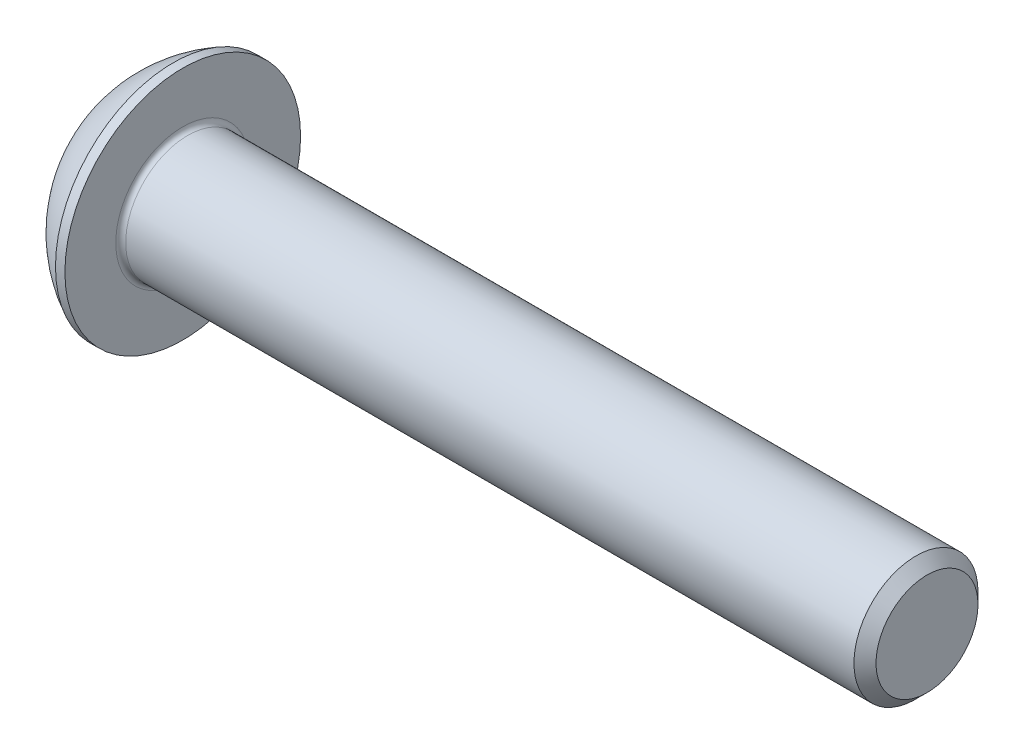
ISO-10303-21;
HEADER;
FILE_DESCRIPTION(('STEP AP214'),'2;1');
FILE_NAME('part.step','',(''),(''),'','','');
FILE_SCHEMA(('AUTOMOTIVE_DESIGN { 1 0 10303 214 1 1 1 1 }'));
ENDSEC;
DATA;
#1=APPLICATION_CONTEXT('core data for automotive mechanical design processes');
#2=APPLICATION_PROTOCOL_DEFINITION('international standard','automotive_design',2000,#1);
#3=PRODUCT_CONTEXT('',#1,'mechanical');
#4=PRODUCT('Part','Part','',(#3));
#5=PRODUCT_RELATED_PRODUCT_CATEGORY('part','',(#4));
#6=PRODUCT_DEFINITION_FORMATION('','',#4);
#7=PRODUCT_DEFINITION_CONTEXT('part definition',#1,'design');
#8=PRODUCT_DEFINITION('design','',#6,#7);
#9=PRODUCT_DEFINITION_SHAPE('','',#8);
#10=(LENGTH_UNIT() NAMED_UNIT(*) SI_UNIT(.MILLI.,.METRE.));
#11=(NAMED_UNIT(*) PLANE_ANGLE_UNIT() SI_UNIT($,.RADIAN.));
#12=(NAMED_UNIT(*) SI_UNIT($,.STERADIAN.) SOLID_ANGLE_UNIT());
#13=UNCERTAINTY_MEASURE_WITH_UNIT(LENGTH_MEASURE(1.E-05),#10,'distance_accuracy_value','');
#14=(GEOMETRIC_REPRESENTATION_CONTEXT(3) GLOBAL_UNCERTAINTY_ASSIGNED_CONTEXT((#13)) GLOBAL_UNIT_ASSIGNED_CONTEXT((#10,
#11,#12)) REPRESENTATION_CONTEXT('',''));
#15=CARTESIAN_POINT('',(0.,0.,0.));
#16=DIRECTION('',(0.,0.,1.));
#17=DIRECTION('',(1.,0.,0.));
#18=AXIS2_PLACEMENT_3D('',#15,#16,#17);
#19=CARTESIAN_POINT('',(-574.924243785843,0.,0.));
#20=DIRECTION('',(-1.,0.,0.));
#21=DIRECTION('',(0.,0.,1.));
#22=AXIS2_PLACEMENT_3D('',#19,#20,#21);
#23=CONICAL_SURFACE('',#22,1000.,1.0471975511966);
#24=DIRECTION('',(-0.5,0.,-0.866025403784438));
#25=VECTOR('',#24,1.);
#26=CARTESIAN_POINT('',(-574.924243785843,-1.22464679914735E-13,-1000.));
#27=LINE('',#26,#25);
#28=CARTESIAN_POINT('',(2.42602540378445,0.,0.));
#29=VERTEX_POINT('',#28);
#30=CARTESIAN_POINT('',(1.56,0.,-1.5));
#31=VERTEX_POINT('',#30);
#32=EDGE_CURVE('E11',#29,#31,#27,.T.);
#33=ORIENTED_EDGE('',*,*,#32,.T.);
#34=CARTESIAN_POINT('',(1.56,0.,0.));
#35=DIRECTION('',(-1.,0.,0.));
#36=DIRECTION('',(0.,0.,1.));
#37=AXIS2_PLACEMENT_3D('',#34,#35,#36);
#38=CIRCLE('',#37,1.5);
#39=CARTESIAN_POINT('',(1.56,-1.29903810567666,-0.75));
#40=VERTEX_POINT('',#39);
#41=EDGE_CURVE('E124',#31,#40,#38,.T.);
#42=ORIENTED_EDGE('',*,*,#41,.T.);
#43=CARTESIAN_POINT('',(1.56,0.,0.));
#44=DIRECTION('',(-1.,0.,0.));
#45=DIRECTION('',(0.,0.,1.));
#46=AXIS2_PLACEMENT_3D('',#43,#44,#45);
#47=CIRCLE('',#46,1.5);
#48=CARTESIAN_POINT('',(1.56,-1.29903810567666,0.75));
#49=VERTEX_POINT('',#48);
#50=EDGE_CURVE('E119',#40,#49,#47,.T.);
#51=ORIENTED_EDGE('',*,*,#50,.T.);
#52=CARTESIAN_POINT('',(1.56,0.,0.));
#53=DIRECTION('',(-1.,0.,0.));
#54=DIRECTION('',(0.,0.,1.));
#55=AXIS2_PLACEMENT_3D('',#52,#53,#54);
#56=CIRCLE('',#55,1.5);
#57=CARTESIAN_POINT('',(1.56,0.,1.5));
#58=VERTEX_POINT('',#57);
#59=EDGE_CURVE('E27',#49,#58,#56,.T.);
#60=ORIENTED_EDGE('',*,*,#59,.T.);
#61=CARTESIAN_POINT('',(1.56,0.,0.));
#62=DIRECTION('',(-1.,0.,0.));
#63=DIRECTION('',(0.,0.,1.));
#64=AXIS2_PLACEMENT_3D('',#61,#62,#63);
#65=CIRCLE('',#64,1.5);
#66=CARTESIAN_POINT('',(1.56,1.29903810567666,0.75));
#67=VERTEX_POINT('',#66);
#68=EDGE_CURVE('E228',#58,#67,#65,.T.);
#69=ORIENTED_EDGE('',*,*,#68,.T.);
#70=CARTESIAN_POINT('',(1.56,0.,0.));
#71=DIRECTION('',(-1.,0.,0.));
#72=DIRECTION('',(0.,0.,1.));
#73=AXIS2_PLACEMENT_3D('',#70,#71,#72);
#74=CIRCLE('',#73,1.5);
#75=CARTESIAN_POINT('',(1.56,1.29903810567666,-0.75));
#76=VERTEX_POINT('',#75);
#77=EDGE_CURVE('E231',#67,#76,#74,.T.);
#78=ORIENTED_EDGE('',*,*,#77,.T.);
#79=CARTESIAN_POINT('',(1.56,0.,0.));
#80=DIRECTION('',(-1.,0.,0.));
#81=DIRECTION('',(0.,0.,1.));
#82=AXIS2_PLACEMENT_3D('',#79,#80,#81);
#83=CIRCLE('',#82,1.5);
#84=EDGE_CURVE('E168',#76,#31,#83,.T.);
#85=ORIENTED_EDGE('',*,*,#84,.T.);
#86=ORIENTED_EDGE('',*,*,#32,.F.);
#87=EDGE_LOOP('',(#33,#42,#51,#60,#69,#78,#85,#86));
#88=FACE_BOUND('',#87,.T.);
#89=ADVANCED_FACE('F16',(#88),#23,.F.);
#90=CARTESIAN_POINT('',(1.56,0.,3.));
#91=DIRECTION('',(-1.,0.,0.));
#92=DIRECTION('',(0.,0.,1.));
#93=AXIS2_PLACEMENT_3D('',#90,#91,#92);
#94=PLANE('',#93);
#95=DIRECTION('',(0.,-0.5,-0.866025403784439));
#96=VECTOR('',#95,1.);
#97=CARTESIAN_POINT('',(1.56,-0.86602540378444,1.5));
#98=LINE('',#97,#96);
#99=CARTESIAN_POINT('',(1.56,-0.866025403784438,1.5));
#100=VERTEX_POINT('',#99);
#101=EDGE_CURVE('E113',#100,#49,#98,.T.);
#102=ORIENTED_EDGE('',*,*,#101,.F.);
#103=DIRECTION('',(0.,-1.,0.));
#104=VECTOR('',#103,1.);
#105=CARTESIAN_POINT('',(1.56,0.,1.5));
#106=LINE('',#105,#104);
#107=EDGE_CURVE('E114',#58,#100,#106,.T.);
#108=ORIENTED_EDGE('',*,*,#107,.F.);
#109=ORIENTED_EDGE('',*,*,#59,.F.);
#110=EDGE_LOOP('',(#102,#108,#109));
#111=FACE_BOUND('',#110,.T.);
#112=ADVANCED_FACE('F111',(#111),#94,.T.);
#113=CARTESIAN_POINT('',(1.56,0.,3.));
#114=DIRECTION('',(-1.,0.,0.));
#115=DIRECTION('',(0.,0.,1.));
#116=AXIS2_PLACEMENT_3D('',#113,#114,#115);
#117=PLANE('',#116);
#118=DIRECTION('',(0.,0.5,-0.866025403784439));
#119=VECTOR('',#118,1.);
#120=CARTESIAN_POINT('',(1.56,-1.73205080756888,0.));
#121=LINE('',#120,#119);
#122=CARTESIAN_POINT('',(1.56,-1.73205080756888,0.));
#123=VERTEX_POINT('',#122);
#124=EDGE_CURVE('E133',#123,#40,#121,.T.);
#125=ORIENTED_EDGE('',*,*,#124,.F.);
#126=DIRECTION('',(0.,-0.5,-0.866025403784439));
#127=VECTOR('',#126,1.);
#128=CARTESIAN_POINT('',(1.56,-1.29903810567666,0.75));
#129=LINE('',#128,#127);
#130=EDGE_CURVE('E130',#49,#123,#129,.T.);
#131=ORIENTED_EDGE('',*,*,#130,.F.);
#132=ORIENTED_EDGE('',*,*,#50,.F.);
#133=EDGE_LOOP('',(#125,#131,#132));
#134=FACE_BOUND('',#133,.T.);
#135=ADVANCED_FACE('F131',(#134),#117,.T.);
#136=CARTESIAN_POINT('',(1.56,0.,3.));
#137=DIRECTION('',(-1.,0.,0.));
#138=DIRECTION('',(0.,0.,1.));
#139=AXIS2_PLACEMENT_3D('',#136,#137,#138);
#140=PLANE('',#139);
#141=DIRECTION('',(0.,1.,0.));
#142=VECTOR('',#141,1.);
#143=CARTESIAN_POINT('',(1.56,-0.866025403784438,-1.5));
#144=LINE('',#143,#142);
#145=CARTESIAN_POINT('',(1.56,-0.866025403784438,-1.5));
#146=VERTEX_POINT('',#145);
#147=EDGE_CURVE('E160',#146,#31,#144,.T.);
#148=ORIENTED_EDGE('',*,*,#147,.F.);
#149=DIRECTION('',(0.,0.5,-0.866025403784439));
#150=VECTOR('',#149,1.);
#151=CARTESIAN_POINT('',(1.56,-1.29903810567666,-0.75));
#152=LINE('',#151,#150);
#153=EDGE_CURVE('E161',#40,#146,#152,.T.);
#154=ORIENTED_EDGE('',*,*,#153,.F.);
#155=ORIENTED_EDGE('',*,*,#41,.F.);
#156=EDGE_LOOP('',(#148,#154,#155));
#157=FACE_BOUND('',#156,.T.);
#158=ADVANCED_FACE('F297',(#157),#140,.T.);
#159=CARTESIAN_POINT('',(1.56,0.,3.));
#160=DIRECTION('',(-1.,0.,0.));
#161=DIRECTION('',(0.,0.,1.));
#162=AXIS2_PLACEMENT_3D('',#159,#160,#161);
#163=PLANE('',#162);
#164=DIRECTION('',(0.,0.5,0.866025403784439));
#165=VECTOR('',#164,1.);
#166=CARTESIAN_POINT('',(1.56,0.866025403784441,-1.5));
#167=LINE('',#166,#165);
#168=CARTESIAN_POINT('',(1.56,0.86602540378444,-1.5));
#169=VERTEX_POINT('',#168);
#170=EDGE_CURVE('E194',#169,#76,#167,.T.);
#171=ORIENTED_EDGE('',*,*,#170,.F.);
#172=DIRECTION('',(0.,1.,0.));
#173=VECTOR('',#172,1.);
#174=CARTESIAN_POINT('',(1.56,0.,-1.5));
#175=LINE('',#174,#173);
#176=EDGE_CURVE('E179',#31,#169,#175,.T.);
#177=ORIENTED_EDGE('',*,*,#176,.F.);
#178=ORIENTED_EDGE('',*,*,#84,.F.);
#179=EDGE_LOOP('',(#171,#177,#178));
#180=FACE_BOUND('',#179,.T.);
#181=ADVANCED_FACE('F299',(#180),#163,.T.);
#182=CARTESIAN_POINT('',(1.56,0.,3.));
#183=DIRECTION('',(-1.,0.,0.));
#184=DIRECTION('',(0.,0.,1.));
#185=AXIS2_PLACEMENT_3D('',#182,#183,#184);
#186=PLANE('',#185);
#187=DIRECTION('',(0.,-0.5,0.866025403784439));
#188=VECTOR('',#187,1.);
#189=CARTESIAN_POINT('',(1.56,1.73205080756888,0.));
#190=LINE('',#189,#188);
#191=CARTESIAN_POINT('',(1.56,1.73205080756888,0.));
#192=VERTEX_POINT('',#191);
#193=EDGE_CURVE('E182',#192,#67,#190,.T.);
#194=ORIENTED_EDGE('',*,*,#193,.F.);
#195=DIRECTION('',(0.,0.5,0.866025403784439));
#196=VECTOR('',#195,1.);
#197=CARTESIAN_POINT('',(1.56,1.29903810567666,-0.75));
#198=LINE('',#197,#196);
#199=EDGE_CURVE('E20',#76,#192,#198,.T.);
#200=ORIENTED_EDGE('',*,*,#199,.F.);
#201=ORIENTED_EDGE('',*,*,#77,.F.);
#202=EDGE_LOOP('',(#194,#200,#201));
#203=FACE_BOUND('',#202,.T.);
#204=ADVANCED_FACE('F18',(#203),#186,.T.);
#205=CARTESIAN_POINT('',(1.56,0.,3.));
#206=DIRECTION('',(-1.,0.,0.));
#207=DIRECTION('',(0.,0.,1.));
#208=AXIS2_PLACEMENT_3D('',#205,#206,#207);
#209=PLANE('',#208);
#210=DIRECTION('',(0.,-1.,0.));
#211=VECTOR('',#210,1.);
#212=CARTESIAN_POINT('',(1.56,0.86602540378444,1.5));
#213=LINE('',#212,#211);
#214=CARTESIAN_POINT('',(1.56,0.86602540378444,1.5));
#215=VERTEX_POINT('',#214);
#216=EDGE_CURVE('E162',#215,#58,#213,.T.);
#217=ORIENTED_EDGE('',*,*,#216,.F.);
#218=DIRECTION('',(0.,-0.5,0.866025403784439));
#219=VECTOR('',#218,1.);
#220=CARTESIAN_POINT('',(1.56,1.29903810567666,0.75));
#221=LINE('',#220,#219);
#222=EDGE_CURVE('E218',#67,#215,#221,.T.);
#223=ORIENTED_EDGE('',*,*,#222,.F.);
#224=ORIENTED_EDGE('',*,*,#68,.F.);
#225=EDGE_LOOP('',(#217,#223,#224));
#226=FACE_BOUND('',#225,.T.);
#227=ADVANCED_FACE('F408',(#226),#209,.T.);
#228=CARTESIAN_POINT('',(1.56,-0.866025403784438,1.5));
#229=DIRECTION('',(0.,0.,-1.));
#230=DIRECTION('',(0.,-1.,0.));
#231=AXIS2_PLACEMENT_3D('',#228,#229,#230);
#232=PLANE('',#231);
#233=ORIENTED_EDGE('',*,*,#216,.T.);
#234=ORIENTED_EDGE('',*,*,#107,.T.);
#235=DIRECTION('',(-1.,0.,0.));
#236=VECTOR('',#235,1.);
#237=CARTESIAN_POINT('',(1.56,-0.866025403784438,1.5));
#238=LINE('',#237,#236);
#239=CARTESIAN_POINT('',(0.,-0.866025403784438,1.5));
#240=VERTEX_POINT('',#239);
#241=EDGE_CURVE('E143',#100,#240,#238,.T.);
#242=ORIENTED_EDGE('',*,*,#241,.T.);
#243=DIRECTION('',(0.,-1.,0.));
#244=VECTOR('',#243,1.);
#245=CARTESIAN_POINT('',(0.,0.86602540378444,1.5));
#246=LINE('',#245,#244);
#247=CARTESIAN_POINT('',(0.,0.86602540378444,1.5));
#248=VERTEX_POINT('',#247);
#249=EDGE_CURVE('E211',#248,#240,#246,.T.);
#250=ORIENTED_EDGE('',*,*,#249,.F.);
#251=DIRECTION('',(-1.,0.,0.));
#252=VECTOR('',#251,1.);
#253=CARTESIAN_POINT('',(1.56,0.86602540378444,1.5));
#254=LINE('',#253,#252);
#255=EDGE_CURVE('E165',#215,#248,#254,.T.);
#256=ORIENTED_EDGE('',*,*,#255,.F.);
#257=EDGE_LOOP('',(#233,#234,#242,#250,#256));
#258=FACE_BOUND('',#257,.T.);
#259=ADVANCED_FACE('F416',(#258),#232,.T.);
#260=CARTESIAN_POINT('',(1.56,0.86602540378444,1.5));
#261=DIRECTION('',(0.,-0.866025403784439,-0.5));
#262=DIRECTION('',(0.,0.5,-0.866025403784439));
#263=AXIS2_PLACEMENT_3D('',#260,#261,#262);
#264=PLANE('',#263);
#265=ORIENTED_EDGE('',*,*,#193,.T.);
#266=ORIENTED_EDGE('',*,*,#222,.T.);
#267=ORIENTED_EDGE('',*,*,#255,.T.);
#268=DIRECTION('',(0.,-0.5,0.866025403784439));
#269=VECTOR('',#268,1.);
#270=CARTESIAN_POINT('',(0.,1.73205080756888,0.));
#271=LINE('',#270,#269);
#272=CARTESIAN_POINT('',(0.,1.73205080756888,0.));
#273=VERTEX_POINT('',#272);
#274=EDGE_CURVE('E259',#273,#248,#271,.T.);
#275=ORIENTED_EDGE('',*,*,#274,.F.);
#276=DIRECTION('',(-1.,0.,0.));
#277=VECTOR('',#276,1.);
#278=CARTESIAN_POINT('',(1.56,1.73205080756888,0.));
#279=LINE('',#278,#277);
#280=EDGE_CURVE('E180',#192,#273,#279,.T.);
#281=ORIENTED_EDGE('',*,*,#280,.F.);
#282=EDGE_LOOP('',(#265,#266,#267,#275,#281));
#283=FACE_BOUND('',#282,.T.);
#284=ADVANCED_FACE('F424',(#283),#264,.T.);
#285=CARTESIAN_POINT('',(1.56,1.73205080756888,0.));
#286=DIRECTION('',(0.,-0.866025403784439,0.5));
#287=DIRECTION('',(-1.,0.,0.));
#288=AXIS2_PLACEMENT_3D('',#285,#286,#287);
#289=PLANE('',#288);
#290=ORIENTED_EDGE('',*,*,#170,.T.);
#291=ORIENTED_EDGE('',*,*,#199,.T.);
#292=ORIENTED_EDGE('',*,*,#280,.T.);
#293=DIRECTION('',(0.,0.5,0.866025403784439));
#294=VECTOR('',#293,1.);
#295=CARTESIAN_POINT('',(0.,0.866025403784441,-1.5));
#296=LINE('',#295,#294);
#297=CARTESIAN_POINT('',(0.,0.86602540378444,-1.5));
#298=VERTEX_POINT('',#297);
#299=EDGE_CURVE('E227',#298,#273,#296,.T.);
#300=ORIENTED_EDGE('',*,*,#299,.F.);
#301=DIRECTION('',(-1.,0.,0.));
#302=VECTOR('',#301,1.);
#303=CARTESIAN_POINT('',(1.56,0.86602540378444,-1.5));
#304=LINE('',#303,#302);
#305=EDGE_CURVE('E187',#169,#298,#304,.T.);
#306=ORIENTED_EDGE('',*,*,#305,.F.);
#307=EDGE_LOOP('',(#290,#291,#292,#300,#306));
#308=FACE_BOUND('',#307,.T.);
#309=ADVANCED_FACE('F295',(#308),#289,.T.);
#310=CARTESIAN_POINT('',(1.56,0.86602540378444,-1.5));
#311=DIRECTION('',(0.,0.,1.));
#312=DIRECTION('',(1.,0.,0.));
#313=AXIS2_PLACEMENT_3D('',#310,#311,#312);
#314=PLANE('',#313);
#315=ORIENTED_EDGE('',*,*,#147,.T.);
#316=ORIENTED_EDGE('',*,*,#176,.T.);
#317=ORIENTED_EDGE('',*,*,#305,.T.);
#318=DIRECTION('',(0.,1.,0.));
#319=VECTOR('',#318,1.);
#320=CARTESIAN_POINT('',(0.,-0.866025403784438,-1.5));
#321=LINE('',#320,#319);
#322=CARTESIAN_POINT('',(0.,-0.866025403784438,-1.5));
#323=VERTEX_POINT('',#322);
#324=EDGE_CURVE('E223',#323,#298,#321,.T.);
#325=ORIENTED_EDGE('',*,*,#324,.F.);
#326=DIRECTION('',(-1.,0.,0.));
#327=VECTOR('',#326,1.);
#328=CARTESIAN_POINT('',(1.56,-0.866025403784438,-1.5));
#329=LINE('',#328,#327);
#330=EDGE_CURVE('E157',#146,#323,#329,.T.);
#331=ORIENTED_EDGE('',*,*,#330,.F.);
#332=EDGE_LOOP('',(#315,#316,#317,#325,#331));
#333=FACE_BOUND('',#332,.T.);
#334=ADVANCED_FACE('F440',(#333),#314,.T.);
#335=CARTESIAN_POINT('',(1.56,-0.866025403784438,-1.5));
#336=DIRECTION('',(0.,0.866025403784439,0.5));
#337=DIRECTION('',(1.,0.,0.));
#338=AXIS2_PLACEMENT_3D('',#335,#336,#337);
#339=PLANE('',#338);
#340=ORIENTED_EDGE('',*,*,#124,.T.);
#341=ORIENTED_EDGE('',*,*,#153,.T.);
#342=ORIENTED_EDGE('',*,*,#330,.T.);
#343=DIRECTION('',(0.,0.5,-0.866025403784439));
#344=VECTOR('',#343,1.);
#345=CARTESIAN_POINT('',(0.,-1.73205080756888,0.));
#346=LINE('',#345,#344);
#347=CARTESIAN_POINT('',(0.,-1.73205080756888,0.));
#348=VERTEX_POINT('',#347);
#349=EDGE_CURVE('E210',#348,#323,#346,.T.);
#350=ORIENTED_EDGE('',*,*,#349,.F.);
#351=DIRECTION('',(-1.,0.,0.));
#352=VECTOR('',#351,1.);
#353=CARTESIAN_POINT('',(1.56,-1.73205080756888,0.));
#354=LINE('',#353,#352);
#355=EDGE_CURVE('E137',#123,#348,#354,.T.);
#356=ORIENTED_EDGE('',*,*,#355,.F.);
#357=EDGE_LOOP('',(#340,#341,#342,#350,#356));
#358=FACE_BOUND('',#357,.T.);
#359=ADVANCED_FACE('F447',(#358),#339,.T.);
#360=CARTESIAN_POINT('',(1.56,-1.73205080756888,0.));
#361=DIRECTION('',(0.,0.866025403784439,-0.5));
#362=DIRECTION('',(-1.,0.,0.));
#363=AXIS2_PLACEMENT_3D('',#360,#361,#362);
#364=PLANE('',#363);
#365=ORIENTED_EDGE('',*,*,#101,.T.);
#366=ORIENTED_EDGE('',*,*,#130,.T.);
#367=ORIENTED_EDGE('',*,*,#355,.T.);
#368=DIRECTION('',(0.,-0.5,-0.866025403784439));
#369=VECTOR('',#368,1.);
#370=CARTESIAN_POINT('',(0.,-0.86602540378444,1.5));
#371=LINE('',#370,#369);
#372=EDGE_CURVE('E206',#240,#348,#371,.T.);
#373=ORIENTED_EDGE('',*,*,#372,.F.);
#374=ORIENTED_EDGE('',*,*,#241,.F.);
#375=EDGE_LOOP('',(#365,#366,#367,#373,#374));
#376=FACE_BOUND('',#375,.T.);
#377=ADVANCED_FACE('F140',(#376),#364,.T.);
#378=CARTESIAN_POINT('',(2.95,0.,0.));
#379=DIRECTION('',(-1.,0.,0.));
#380=DIRECTION('',(0.,0.,1.));
#381=AXIS2_PLACEMENT_3D('',#378,#379,#380);
#382=TOROIDAL_SURFACE('',#381,2.7,0.2);
#383=CARTESIAN_POINT('',(2.75,0.,0.));
#384=DIRECTION('',(-1.,0.,0.));
#385=DIRECTION('',(0.,0.,1.));
#386=AXIS2_PLACEMENT_3D('',#383,#384,#385);
#387=CIRCLE('',#386,2.7);
#388=CARTESIAN_POINT('',(2.75,0.,-2.7));
#389=VERTEX_POINT('',#388);
#390=EDGE_CURVE('E188',#389,#389,#387,.T.);
#391=ORIENTED_EDGE('',*,*,#390,.F.);
#392=CARTESIAN_POINT('',(2.95,0.,-2.7));
#393=DIRECTION('',(0.,1.,0.));
#394=DIRECTION('',(0.,0.,-1.));
#395=AXIS2_PLACEMENT_3D('',#392,#393,#394);
#396=CIRCLE('',#395,0.2);
#397=CARTESIAN_POINT('',(2.95,0.,-2.5));
#398=VERTEX_POINT('',#397);
#399=EDGE_CURVE('E145',#389,#398,#396,.T.);
#400=ORIENTED_EDGE('',*,*,#399,.T.);
#401=CARTESIAN_POINT('',(2.95,0.,0.));
#402=DIRECTION('',(1.,0.,0.));
#403=DIRECTION('',(0.,0.,1.));
#404=AXIS2_PLACEMENT_3D('',#401,#402,#403);
#405=CIRCLE('',#404,2.5);
#406=EDGE_CURVE('E192',#398,#398,#405,.T.);
#407=ORIENTED_EDGE('',*,*,#406,.F.);
#408=ORIENTED_EDGE('',*,*,#399,.F.);
#409=EDGE_LOOP('',(#391,#400,#407,#408));
#410=FACE_BOUND('',#409,.T.);
#411=ADVANCED_FACE('F303',(#410),#382,.F.);
#412=CARTESIAN_POINT('',(32.75,0.,0.));
#413=DIRECTION('',(-1.,0.,0.));
#414=DIRECTION('',(0.,0.,1.));
#415=AXIS2_PLACEMENT_3D('',#412,#413,#414);
#416=PLANE('',#415);
#417=CARTESIAN_POINT('',(32.75,0.,0.));
#418=DIRECTION('',(-1.,0.,0.));
#419=DIRECTION('',(0.,0.,1.));
#420=AXIS2_PLACEMENT_3D('',#417,#418,#419);
#421=CIRCLE('',#420,2.055);
#422=CARTESIAN_POINT('',(32.75,0.,-2.055));
#423=VERTEX_POINT('',#422);
#424=EDGE_CURVE('E152',#423,#423,#421,.T.);
#425=ORIENTED_EDGE('',*,*,#424,.F.);
#426=EDGE_LOOP('',(#425));
#427=FACE_BOUND('',#426,.T.);
#428=ADVANCED_FACE('F301',(#427),#416,.F.);
#429=CARTESIAN_POINT('',(32.75,0.,0.));
#430=DIRECTION('',(-1.,0.,0.));
#431=DIRECTION('',(0.,0.,1.));
#432=AXIS2_PLACEMENT_3D('',#429,#430,#431);
#433=CONICAL_SURFACE('',#432,2.055,0.785398163397436);
#434=CARTESIAN_POINT('',(32.305,0.,0.));
#435=DIRECTION('',(-1.,0.,0.));
#436=DIRECTION('',(0.,0.,1.));
#437=AXIS2_PLACEMENT_3D('',#434,#435,#436);
#438=CIRCLE('',#437,2.5);
#439=CARTESIAN_POINT('',(32.305,0.,-2.5));
#440=VERTEX_POINT('',#439);
#441=EDGE_CURVE('E201',#440,#440,#438,.T.);
#442=ORIENTED_EDGE('',*,*,#441,.F.);
#443=DIRECTION('',(0.707106781186556,0.,0.707106781186539));
#444=VECTOR('',#443,1.);
#445=CARTESIAN_POINT('',(32.75,0.,-2.055));
#446=LINE('',#445,#444);
#447=EDGE_CURVE('E171',#440,#423,#446,.T.);
#448=ORIENTED_EDGE('',*,*,#447,.T.);
#449=ORIENTED_EDGE('',*,*,#424,.T.);
#450=ORIENTED_EDGE('',*,*,#447,.F.);
#451=EDGE_LOOP('',(#442,#448,#449,#450));
#452=FACE_BOUND('',#451,.T.);
#453=ADVANCED_FACE('F282',(#452),#433,.T.);
#454=CARTESIAN_POINT('',(0.,0.,0.));
#455=DIRECTION('',(-1.,0.,0.));
#456=DIRECTION('',(0.,0.,1.));
#457=AXIS2_PLACEMENT_3D('',#454,#455,#456);
#458=CYLINDRICAL_SURFACE('',#457,2.5);
#459=ORIENTED_EDGE('',*,*,#406,.T.);
#460=DIRECTION('',(1.,0.,0.));
#461=VECTOR('',#460,1.);
#462=CARTESIAN_POINT('',(0.,0.,-2.5));
#463=LINE('',#462,#461);
#464=EDGE_CURVE('E204',#398,#440,#463,.T.);
#465=ORIENTED_EDGE('',*,*,#464,.T.);
#466=ORIENTED_EDGE('',*,*,#441,.T.);
#467=ORIENTED_EDGE('',*,*,#464,.F.);
#468=EDGE_LOOP('',(#459,#465,#466,#467));
#469=FACE_BOUND('',#468,.T.);
#470=ADVANCED_FACE('F272',(#469),#458,.T.);
#471=CARTESIAN_POINT('',(2.75,2.5,0.));
#472=DIRECTION('',(-1.,0.,0.));
#473=DIRECTION('',(0.,0.,1.));
#474=AXIS2_PLACEMENT_3D('',#471,#472,#473);
#475=PLANE('',#474);
#476=ORIENTED_EDGE('',*,*,#390,.T.);
#477=EDGE_LOOP('',(#476));
#478=FACE_BOUND('',#477,.T.);
#479=CARTESIAN_POINT('',(2.75,0.,0.));
#480=DIRECTION('',(-1.,0.,0.));
#481=DIRECTION('',(0.,0.,1.));
#482=AXIS2_PLACEMENT_3D('',#479,#480,#481);
#483=CIRCLE('',#482,4.75);
#484=CARTESIAN_POINT('',(2.75,0.,-4.75));
#485=VERTEX_POINT('',#484);
#486=EDGE_CURVE('E193',#485,#485,#483,.T.);
#487=ORIENTED_EDGE('',*,*,#486,.F.);
#488=EDGE_LOOP('',(#487));
#489=FACE_BOUND('',#488,.T.);
#490=ADVANCED_FACE('F270',(#478,#489),#475,.F.);
#491=CARTESIAN_POINT('',(0.,0.,0.));
#492=DIRECTION('',(-1.,0.,0.));
#493=DIRECTION('',(0.,0.,1.));
#494=AXIS2_PLACEMENT_3D('',#491,#492,#493);
#495=CYLINDRICAL_SURFACE('',#494,4.75);
#496=CARTESIAN_POINT('',(2.37,0.,0.));
#497=DIRECTION('',(-1.,0.,0.));
#498=DIRECTION('',(0.,0.,1.));
#499=AXIS2_PLACEMENT_3D('',#496,#497,#498);
#500=CIRCLE('',#499,4.75);
#501=CARTESIAN_POINT('',(2.37,0.,-4.75));
#502=VERTEX_POINT('',#501);
#503=EDGE_CURVE('E258',#502,#502,#500,.T.);
#504=ORIENTED_EDGE('',*,*,#503,.F.);
#505=DIRECTION('',(1.,0.,0.));
#506=VECTOR('',#505,1.);
#507=CARTESIAN_POINT('',(0.,0.,-4.75));
#508=LINE('',#507,#506);
#509=EDGE_CURVE('E254',#502,#485,#508,.T.);
#510=ORIENTED_EDGE('',*,*,#509,.T.);
#511=ORIENTED_EDGE('',*,*,#486,.T.);
#512=ORIENTED_EDGE('',*,*,#509,.F.);
#513=EDGE_LOOP('',(#504,#510,#511,#512));
#514=FACE_BOUND('',#513,.T.);
#515=ADVANCED_FACE('F267',(#514),#495,.T.);
#516=CARTESIAN_POINT('',(4.75501582278481,0.,0.));
#517=DIRECTION('',(0.,0.,1.));
#518=DIRECTION('',(-0.999995616798622,0.00296080792091859,0.));
#519=AXIS2_PLACEMENT_3D('',#516,#517,#518);
#520=SPHERICAL_SURFACE('',#519,5.3151482081814);
#521=CARTESIAN_POINT('',(4.75501582278481,0.,0.));
#522=DIRECTION('',(-1.,0.,0.));
#523=DIRECTION('',(0.,0.,1.));
#524=AXIS2_PLACEMENT_3D('',#521,#522,#523);
#525=SPHERICAL_SURFACE('',#524,5.3151482081814);
#526=CARTESIAN_POINT('',(0.,0.,0.));
#527=DIRECTION('',(-1.,0.,0.));
#528=DIRECTION('',(0.,0.,1.));
#529=AXIS2_PLACEMENT_3D('',#526,#527,#528);
#530=CIRCLE('',#529,2.375);
#531=CARTESIAN_POINT('',(0.,0.,2.375));
#532=VERTEX_POINT('',#531);
#533=EDGE_CURVE('E219',#532,#532,#530,.T.);
#534=ORIENTED_EDGE('',*,*,#533,.F.);
#535=EDGE_LOOP('',(#534));
#536=FACE_BOUND('',#535,.T.);
#537=ORIENTED_EDGE('',*,*,#503,.T.);
#538=EDGE_LOOP('',(#537));
#539=FACE_BOUND('',#538,.T.);
#540=ADVANCED_FACE('F280',(#536,#539),#525,.T.);
#541=CARTESIAN_POINT('',(0.,0.,0.));
#542=DIRECTION('',(-1.,0.,0.));
#543=DIRECTION('',(0.,0.,1.));
#544=AXIS2_PLACEMENT_3D('',#541,#542,#543);
#545=PLANE('',#544);
#546=ORIENTED_EDGE('',*,*,#249,.T.);
#547=ORIENTED_EDGE('',*,*,#372,.T.);
#548=ORIENTED_EDGE('',*,*,#349,.T.);
#549=ORIENTED_EDGE('',*,*,#324,.T.);
#550=ORIENTED_EDGE('',*,*,#299,.T.);
#551=ORIENTED_EDGE('',*,*,#274,.T.);
#552=EDGE_LOOP('',(#546,#547,#548,#549,#550,#551));
#553=FACE_BOUND('',#552,.T.);
#554=ORIENTED_EDGE('',*,*,#533,.T.);
#555=EDGE_LOOP('',(#554));
#556=FACE_BOUND('',#555,.T.);
#557=ADVANCED_FACE('F337',(#553,#556),#545,.T.);
#558=CLOSED_SHELL('',(#89,#112,#135,#158,#181,#204,#227,#259,#284,#309,#334,#359,#377,#411,#428,
#453,#470,#490,#515,#540,#557));
#559=MANIFOLD_SOLID_BREP('B1',#558);
#560=ADVANCED_BREP_SHAPE_REPRESENTATION('',(#18,#559),#14);
#561=SHAPE_DEFINITION_REPRESENTATION(#9,#560);
ENDSEC;
END-ISO-10303-21;
